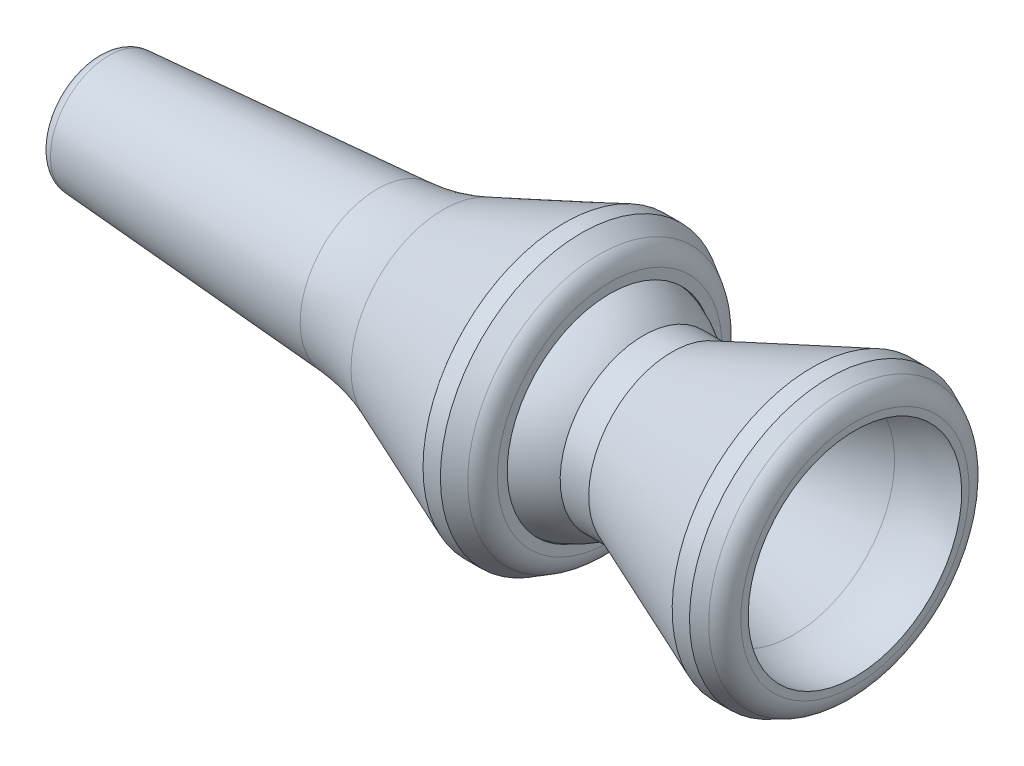
ISO-10303-21;
HEADER;
FILE_DESCRIPTION(('STEP AP214'),'2;1');
FILE_NAME('part.step','',(''),(''),'','','');
FILE_SCHEMA(('AUTOMOTIVE_DESIGN { 1 0 10303 214 1 1 1 1 }'));
ENDSEC;
DATA;
#1=APPLICATION_CONTEXT('core data for automotive mechanical design processes');
#2=APPLICATION_PROTOCOL_DEFINITION('international standard','automotive_design',2000,#1);
#3=PRODUCT_CONTEXT('',#1,'mechanical');
#4=PRODUCT('Part','Part','',(#3));
#5=PRODUCT_RELATED_PRODUCT_CATEGORY('part','',(#4));
#6=PRODUCT_DEFINITION_FORMATION('','',#4);
#7=PRODUCT_DEFINITION_CONTEXT('part definition',#1,'design');
#8=PRODUCT_DEFINITION('design','',#6,#7);
#9=PRODUCT_DEFINITION_SHAPE('','',#8);
#10=(LENGTH_UNIT() NAMED_UNIT(*) SI_UNIT(.MILLI.,.METRE.));
#11=(NAMED_UNIT(*) PLANE_ANGLE_UNIT() SI_UNIT($,.RADIAN.));
#12=(NAMED_UNIT(*) SI_UNIT($,.STERADIAN.) SOLID_ANGLE_UNIT());
#13=UNCERTAINTY_MEASURE_WITH_UNIT(LENGTH_MEASURE(1.E-05),#10,'distance_accuracy_value','');
#14=(GEOMETRIC_REPRESENTATION_CONTEXT(3) GLOBAL_UNCERTAINTY_ASSIGNED_CONTEXT((#13)) GLOBAL_UNIT_ASSIGNED_CONTEXT((#10,
#11,#12)) REPRESENTATION_CONTEXT('',''));
#15=CARTESIAN_POINT('',(0.,0.,0.));
#16=DIRECTION('',(0.,0.,1.));
#17=DIRECTION('',(1.,0.,0.));
#18=AXIS2_PLACEMENT_3D('',#15,#16,#17);
#19=CARTESIAN_POINT('',(-177.5841,3.3655,0.));
#20=DIRECTION('',(1.,0.,0.));
#21=DIRECTION('',(0.,1.,0.));
#22=AXIS2_PLACEMENT_3D('',#19,#20,#21);
#23=PLANE('',#22);
#24=CARTESIAN_POINT('',(-177.5841,0.,0.));
#25=DIRECTION('',(1.,0.,0.));
#26=DIRECTION('',(0.,1.,0.));
#27=AXIS2_PLACEMENT_3D('',#24,#25,#26);
#28=CIRCLE('',#27,2.6549235043631);
#29=CARTESIAN_POINT('',(-177.5841,2.6549235043631,0.));
#30=VERTEX_POINT('',#29);
#31=EDGE_CURVE('E77',#30,#30,#28,.F.);
#32=ORIENTED_EDGE('',*,*,#31,.T.);
#33=EDGE_LOOP('',(#32));
#34=FACE_BOUND('',#33,.T.);
#35=CARTESIAN_POINT('',(-177.5841,0.,0.));
#36=DIRECTION('',(-1.,0.,0.));
#37=DIRECTION('',(0.,-1.,0.));
#38=AXIS2_PLACEMENT_3D('',#35,#36,#37);
#39=CIRCLE('',#38,1.5875);
#40=CARTESIAN_POINT('',(-177.5841,-1.5875,0.));
#41=VERTEX_POINT('',#40);
#42=EDGE_CURVE('E93',#41,#41,#39,.T.);
#43=ORIENTED_EDGE('',*,*,#42,.F.);
#44=EDGE_LOOP('',(#43));
#45=FACE_BOUND('',#44,.T.);
#46=ADVANCED_FACE('F53',(#34,#45),#23,.F.);
#47=CARTESIAN_POINT('',(-177.5841,0.,0.));
#48=DIRECTION('',(1.,0.,0.));
#49=DIRECTION('',(0.,1.,0.));
#50=AXIS2_PLACEMENT_3D('',#47,#48,#49);
#51=CONICAL_SURFACE('',#50,1.5875,0.0698131700797733);
#52=CARTESIAN_POINT('',(-159.235370615463,0.,0.));
#53=DIRECTION('',(-1.,0.,0.));
#54=DIRECTION('',(0.,-1.,0.));
#55=AXIS2_PLACEMENT_3D('',#52,#53,#54);
#56=CIRCLE('',#55,2.87056814907489);
#57=CARTESIAN_POINT('',(-159.235370615463,-2.87056814907489,0.));
#58=VERTEX_POINT('',#57);
#59=EDGE_CURVE('E97',#58,#58,#56,.T.);
#60=ORIENTED_EDGE('',*,*,#59,.F.);
#61=EDGE_LOOP('',(#60));
#62=FACE_BOUND('',#61,.T.);
#63=ORIENTED_EDGE('',*,*,#42,.T.);
#64=EDGE_LOOP('',(#63));
#65=FACE_BOUND('',#64,.T.);
#66=ADVANCED_FACE('F135',(#62,#65),#51,.F.);
#67=CARTESIAN_POINT('',(-159.235370615463,0.,0.));
#68=DIRECTION('',(1.,0.,0.));
#69=DIRECTION('',(0.,1.,0.));
#70=AXIS2_PLACEMENT_3D('',#67,#68,#69);
#71=CONICAL_SURFACE('',#70,2.87056814907489,0.383972435438754);
#72=CARTESIAN_POINT('',(-152.0317,0.,0.));
#73=DIRECTION('',(-1.,0.,0.));
#74=DIRECTION('',(0.,-1.,0.));
#75=AXIS2_PLACEMENT_3D('',#72,#73,#74);
#76=CIRCLE('',#75,5.78104);
#77=CARTESIAN_POINT('',(-152.0317,-5.78103999999999,0.));
#78=VERTEX_POINT('',#77);
#79=EDGE_CURVE('E101',#78,#78,#76,.T.);
#80=ORIENTED_EDGE('',*,*,#79,.F.);
#81=EDGE_LOOP('',(#80));
#82=FACE_BOUND('',#81,.T.);
#83=ORIENTED_EDGE('',*,*,#59,.T.);
#84=EDGE_LOOP('',(#83));
#85=FACE_BOUND('',#84,.T.);
#86=ADVANCED_FACE('F141',(#82,#85),#71,.F.);
#87=CARTESIAN_POINT('',(-149.703467467898,0.,0.));
#88=DIRECTION('',(-1.,0.,0.));
#89=DIRECTION('',(0.,-1.,0.));
#90=AXIS2_PLACEMENT_3D('',#87,#88,#89);
#91=DEGENERATE_TOROIDAL_SURFACE('',#90,0.00370612809085557,6.2357,.F.);
#92=CARTESIAN_POINT('',(-148.0439,0.,0.));
#93=DIRECTION('',(-1.,0.,0.));
#94=DIRECTION('',(0.,-1.,0.));
#95=AXIS2_PLACEMENT_3D('',#92,#93,#94);
#96=CIRCLE('',#95,6.00709999999999);
#97=CARTESIAN_POINT('',(-148.0439,-6.00709999999999,0.));
#98=VERTEX_POINT('',#97);
#99=EDGE_CURVE('E105',#98,#98,#96,.T.);
#100=ORIENTED_EDGE('',*,*,#99,.F.);
#101=EDGE_LOOP('',(#100));
#102=FACE_BOUND('',#101,.T.);
#103=ORIENTED_EDGE('',*,*,#79,.T.);
#104=EDGE_LOOP('',(#103));
#105=FACE_BOUND('',#104,.T.);
#106=ADVANCED_FACE('F170',(#102,#105),#91,.T.);
#107=CARTESIAN_POINT('',(-177.5841,0.,0.));
#108=DIRECTION('',(-1.,0.,0.));
#109=DIRECTION('',(0.,-1.,0.));
#110=AXIS2_PLACEMENT_3D('',#107,#108,#109);
#111=CYLINDRICAL_SURFACE('',#110,6.00709999999999);
#112=CARTESIAN_POINT('',(-147.5359,0.,0.));
#113=DIRECTION('',(-1.,0.,0.));
#114=DIRECTION('',(0.,-1.,0.));
#115=AXIS2_PLACEMENT_3D('',#112,#113,#114);
#116=CIRCLE('',#115,6.00709999999999);
#117=CARTESIAN_POINT('',(-147.5359,-6.00709999999999,0.));
#118=VERTEX_POINT('',#117);
#119=EDGE_CURVE('E109',#118,#118,#116,.T.);
#120=ORIENTED_EDGE('',*,*,#119,.F.);
#121=EDGE_LOOP('',(#120));
#122=FACE_BOUND('',#121,.T.);
#123=ORIENTED_EDGE('',*,*,#99,.T.);
#124=EDGE_LOOP('',(#123));
#125=FACE_BOUND('',#124,.T.);
#126=ADVANCED_FACE('F131',(#122,#125),#111,.F.);
#127=CARTESIAN_POINT('',(-147.5359,7.31449470556792,0.));
#128=DIRECTION('',(-1.,0.,0.));
#129=DIRECTION('',(0.,-1.,0.));
#130=AXIS2_PLACEMENT_3D('',#127,#128,#129);
#131=PLANE('',#130);
#132=CARTESIAN_POINT('',(-147.5359,0.,0.));
#133=DIRECTION('',(-1.,0.,0.));
#134=DIRECTION('',(0.,-1.,0.));
#135=AXIS2_PLACEMENT_3D('',#132,#133,#134);
#136=CIRCLE('',#135,6.5812598636971);
#137=CARTESIAN_POINT('',(-147.5359,-6.58125986369709,0.));
#138=VERTEX_POINT('',#137);
#139=EDGE_CURVE('E66',#138,#138,#136,.F.);
#140=ORIENTED_EDGE('',*,*,#139,.T.);
#141=EDGE_LOOP('',(#140));
#142=FACE_BOUND('',#141,.T.);
#143=ORIENTED_EDGE('',*,*,#119,.T.);
#144=EDGE_LOOP('',(#143));
#145=FACE_BOUND('',#144,.T.);
#146=ADVANCED_FACE('F122',(#142,#145),#131,.F.);
#147=CARTESIAN_POINT('',(-147.5359,0.,0.));
#148=DIRECTION('',(-1.,0.,0.));
#149=DIRECTION('',(0.,-1.,0.));
#150=AXIS2_PLACEMENT_3D('',#147,#148,#149);
#151=CONICAL_SURFACE('',#150,7.31449470556792,0.5235987755983);
#152=CARTESIAN_POINT('',(-148.1709,0.,0.));
#153=DIRECTION('',(1.,0.,0.));
#154=DIRECTION('',(0.,1.,0.));
#155=AXIS2_PLACEMENT_3D('',#152,#153,#154);
#156=CIRCLE('',#155,7.68111212650333);
#157=CARTESIAN_POINT('',(-148.1709,7.68111212650334,0.));
#158=VERTEX_POINT('',#157);
#159=EDGE_CURVE('E71',#158,#158,#156,.F.);
#160=ORIENTED_EDGE('',*,*,#159,.T.);
#161=EDGE_LOOP('',(#160));
#162=FACE_BOUND('',#161,.T.);
#163=CARTESIAN_POINT('',(-149.1869,0.,0.));
#164=DIRECTION('',(-1.,0.,0.));
#165=DIRECTION('',(0.,-1.,0.));
#166=AXIS2_PLACEMENT_3D('',#163,#164,#165);
#167=CIRCLE('',#166,8.26769999999999);
#168=CARTESIAN_POINT('',(-149.1869,-8.26769999999999,0.));
#169=VERTEX_POINT('',#168);
#170=EDGE_CURVE('E113',#169,#169,#167,.T.);
#171=ORIENTED_EDGE('',*,*,#170,.F.);
#172=EDGE_LOOP('',(#171));
#173=FACE_BOUND('',#172,.T.);
#174=ADVANCED_FACE('F120',(#162,#173),#151,.T.);
#175=CARTESIAN_POINT('',(-177.5841,0.,0.));
#176=DIRECTION('',(-1.,0.,0.));
#177=DIRECTION('',(0.,-1.,0.));
#178=AXIS2_PLACEMENT_3D('',#175,#176,#177);
#179=CYLINDRICAL_SURFACE('',#178,8.26769999999999);
#180=CARTESIAN_POINT('',(-150.202406274015,0.,0.));
#181=DIRECTION('',(1.,0.,0.));
#182=DIRECTION('',(0.,1.,0.));
#183=AXIS2_PLACEMENT_3D('',#180,#181,#182);
#184=CIRCLE('',#183,8.26769999999999);
#185=CARTESIAN_POINT('',(-150.202406274015,8.2677,0.));
#186=VERTEX_POINT('',#185);
#187=EDGE_CURVE('E12',#186,#186,#184,.T.);
#188=ORIENTED_EDGE('',*,*,#187,.T.);
#189=EDGE_LOOP('',(#188));
#190=FACE_BOUND('',#189,.T.);
#191=ORIENTED_EDGE('',*,*,#170,.T.);
#192=EDGE_LOOP('',(#191));
#193=FACE_BOUND('',#192,.T.);
#194=ADVANCED_FACE('F118',(#190,#193),#179,.T.);
#195=CARTESIAN_POINT('',(-150.2029,0.,0.));
#196=DIRECTION('',(1.,0.,0.));
#197=DIRECTION('',(0.,1.,0.));
#198=AXIS2_PLACEMENT_3D('',#195,#196,#197);
#199=CONICAL_SURFACE('',#198,8.26769999999999,0.383972435438754);
#200=CARTESIAN_POINT('',(-150.203357774762,0.,0.));
#201=DIRECTION('',(-1.,0.,0.));
#202=DIRECTION('',(0.,-1.,0.));
#203=AXIS2_PLACEMENT_3D('',#200,#201,#202);
#204=CIRCLE('',#203,8.2675150469906);
#205=CARTESIAN_POINT('',(-150.203357774762,-8.26751504699059,0.));
#206=VERTEX_POINT('',#205);
#207=EDGE_CURVE('E61',#206,#206,#204,.T.);
#208=ORIENTED_EDGE('',*,*,#207,.T.);
#209=EDGE_LOOP('',(#208));
#210=FACE_BOUND('',#209,.T.);
#211=CARTESIAN_POINT('',(-157.2798950349,0.,0.));
#212=DIRECTION('',(1.,0.,0.));
#213=DIRECTION('',(0.,1.,0.));
#214=AXIS2_PLACEMENT_3D('',#211,#212,#213);
#215=CIRCLE('',#214,5.4084084057952);
#216=CARTESIAN_POINT('',(-157.2798950349,5.40840840579521,0.));
#217=VERTEX_POINT('',#216);
#218=EDGE_CURVE('E81',#217,#217,#215,.T.);
#219=ORIENTED_EDGE('',*,*,#218,.T.);
#220=EDGE_LOOP('',(#219));
#221=FACE_BOUND('',#220,.T.);
#222=ADVANCED_FACE('F129',(#210,#221),#199,.T.);
#223=CARTESIAN_POINT('',(-159.144909032621,0.,0.));
#224=DIRECTION('',(1.,0.,0.));
#225=DIRECTION('',(0.,1.,0.));
#226=AXIS2_PLACEMENT_3D('',#223,#224,#225);
#227=CONICAL_SURFACE('',#226,4.65489383916642,0.0698131700797733);
#228=CARTESIAN_POINT('',(-161.151491554732,0.,0.));
#229=DIRECTION('',(1.,0.,0.));
#230=DIRECTION('',(0.,1.,0.));
#231=AXIS2_PLACEMENT_3D('',#228,#229,#230);
#232=CIRCLE('',#231,4.51457992049362);
#233=CARTESIAN_POINT('',(-161.151491554732,4.51457992049363,0.));
#234=VERTEX_POINT('',#233);
#235=EDGE_CURVE('E85',#234,#234,#232,.F.);
#236=ORIENTED_EDGE('',*,*,#235,.T.);
#237=EDGE_LOOP('',(#236));
#238=FACE_BOUND('',#237,.T.);
#239=CARTESIAN_POINT('',(-176.875254432993,0.,0.));
#240=DIRECTION('',(-1.,0.,0.));
#241=DIRECTION('',(0.,-1.,0.));
#242=AXIS2_PLACEMENT_3D('',#239,#240,#241);
#243=CIRCLE('',#242,3.41506731066109);
#244=CARTESIAN_POINT('',(-176.875254432993,-3.41506731066109,0.));
#245=VERTEX_POINT('',#244);
#246=EDGE_CURVE('E89',#245,#245,#243,.F.);
#247=ORIENTED_EDGE('',*,*,#246,.T.);
#248=EDGE_LOOP('',(#247));
#249=FACE_BOUND('',#248,.T.);
#250=ADVANCED_FACE('F151',(#238,#249),#227,.T.);
#251=CARTESIAN_POINT('',(-162.037398771282,0.,0.));
#252=DIRECTION('',(-1.,0.,0.));
#253=DIRECTION('',(0.,-1.,0.));
#254=AXIS2_PLACEMENT_3D('',#251,#252,#253);
#255=TOROIDAL_SURFACE('',#254,17.1836433587934,12.7);
#256=ORIENTED_EDGE('',*,*,#218,.F.);
#257=EDGE_LOOP('',(#256));
#258=FACE_BOUND('',#257,.T.);
#259=ORIENTED_EDGE('',*,*,#235,.F.);
#260=EDGE_LOOP('',(#259));
#261=FACE_BOUND('',#260,.T.);
#262=ADVANCED_FACE('F147',(#258,#261),#255,.F.);
#263=CARTESIAN_POINT('',(-176.8221,0.,0.));
#264=DIRECTION('',(1.,0.,0.));
#265=DIRECTION('',(0.,1.,0.));
#266=AXIS2_PLACEMENT_3D('',#263,#264,#265);
#267=TOROIDAL_SURFACE('',#266,2.6549235043631,0.762);
#268=ORIENTED_EDGE('',*,*,#246,.F.);
#269=EDGE_LOOP('',(#268));
#270=FACE_BOUND('',#269,.T.);
#271=ORIENTED_EDGE('',*,*,#31,.F.);
#272=EDGE_LOOP('',(#271));
#273=FACE_BOUND('',#272,.T.);
#274=ADVANCED_FACE('F150',(#270,#273),#267,.T.);
#275=CARTESIAN_POINT('',(-148.8059,0.,0.));
#276=DIRECTION('',(-1.,0.,0.));
#277=DIRECTION('',(0.,-1.,0.));
#278=AXIS2_PLACEMENT_3D('',#275,#276,#277);
#279=TOROIDAL_SURFACE('',#278,6.5812598636971,1.27);
#280=ORIENTED_EDGE('',*,*,#139,.F.);
#281=EDGE_LOOP('',(#280));
#282=FACE_BOUND('',#281,.T.);
#283=ORIENTED_EDGE('',*,*,#159,.F.);
#284=EDGE_LOOP('',(#283));
#285=FACE_BOUND('',#284,.T.);
#286=ADVANCED_FACE('F154',(#282,#285),#279,.T.);
#287=CARTESIAN_POINT('',(-150.202406274015,0.,0.));
#288=DIRECTION('',(1.,0.,0.));
#289=DIRECTION('',(0.,1.,0.));
#290=AXIS2_PLACEMENT_3D('',#287,#288,#289);
#291=TOROIDAL_SURFACE('',#290,8.26515999999999,0.00254);
#292=ORIENTED_EDGE('',*,*,#187,.F.);
#293=EDGE_LOOP('',(#292));
#294=FACE_BOUND('',#293,.T.);
#295=ORIENTED_EDGE('',*,*,#207,.F.);
#296=EDGE_LOOP('',(#295));
#297=FACE_BOUND('',#296,.T.);
#298=ADVANCED_FACE('F55',(#294,#297),#291,.T.);
#299=CLOSED_SHELL('',(#46,#66,#86,#106,#126,#146,#174,#194,#222,#250,#262,#274,#286,#298));
#300=MANIFOLD_SOLID_BREP('B2',#299);
#301=CARTESIAN_POINT('',(-149.52952572709,0.,0.));
#302=DIRECTION('',(-1.,0.,0.));
#303=DIRECTION('',(0.,-1.,0.));
#304=AXIS2_PLACEMENT_3D('',#301,#302,#303);
#305=DEGENERATE_TOROIDAL_SURFACE('',#304,0.000186321539720683,6.2865,.T.);
#306=CARTESIAN_POINT('',(-152.4,0.,0.));
#307=DIRECTION('',(-1.,0.,0.));
#308=DIRECTION('',(0.,-1.,0.));
#309=AXIS2_PLACEMENT_3D('',#306,#307,#308);
#310=CIRCLE('',#309,5.59307999999999);
#311=CARTESIAN_POINT('',(-152.4,-5.59307999999997,0.));
#312=VERTEX_POINT('',#311);
#313=EDGE_CURVE('E321',#312,#312,#310,.T.);
#314=ORIENTED_EDGE('',*,*,#313,.F.);
#315=EDGE_LOOP('',(#314));
#316=FACE_BOUND('',#315,.T.);
#317=CARTESIAN_POINT('',(-145.56232,0.,0.));
#318=DIRECTION('',(-1.,0.,0.));
#319=DIRECTION('',(0.,-1.,0.));
#320=AXIS2_PLACEMENT_3D('',#317,#318,#319);
#321=CIRCLE('',#320,4.87679999999998);
#322=CARTESIAN_POINT('',(-145.56232,-4.87679999999996,0.));
#323=VERTEX_POINT('',#322);
#324=EDGE_CURVE('E348',#323,#323,#321,.T.);
#325=ORIENTED_EDGE('',*,*,#324,.T.);
#326=EDGE_LOOP('',(#325));
#327=FACE_BOUND('',#326,.T.);
#328=ADVANCED_FACE('F301',(#316,#327),#305,.T.);
#329=CARTESIAN_POINT('',(-152.4,5.59308,0.));
#330=DIRECTION('',(1.,0.,0.));
#331=DIRECTION('',(0.,1.,0.));
#332=AXIS2_PLACEMENT_3D('',#329,#330,#331);
#333=PLANE('',#332);
#334=CARTESIAN_POINT('',(-152.4,0.,0.));
#335=DIRECTION('',(1.,0.,0.));
#336=DIRECTION('',(0.,1.,0.));
#337=AXIS2_PLACEMENT_3D('',#334,#335,#336);
#338=CIRCLE('',#337,4.68603720415648);
#339=CARTESIAN_POINT('',(-152.4,4.6860372041565,0.));
#340=VERTEX_POINT('',#339);
#341=EDGE_CURVE('E52',#340,#340,#338,.T.);
#342=ORIENTED_EDGE('',*,*,#341,.T.);
#343=EDGE_LOOP('',(#342));
#344=FACE_BOUND('',#343,.T.);
#345=ORIENTED_EDGE('',*,*,#313,.T.);
#346=EDGE_LOOP('',(#345));
#347=FACE_BOUND('',#346,.T.);
#348=ADVANCED_FACE('F384',(#344,#347),#333,.F.);
#349=CARTESIAN_POINT('',(-295.1861,0.,0.));
#350=DIRECTION('',(-1.,0.,0.));
#351=DIRECTION('',(0.,-1.,0.));
#352=AXIS2_PLACEMENT_3D('',#349,#350,#351);
#353=CYLINDRICAL_SURFACE('',#352,4.50849999999998);
#354=CARTESIAN_POINT('',(-151.96058,0.,0.));
#355=DIRECTION('',(1.,0.,0.));
#356=DIRECTION('',(0.,1.,0.));
#357=AXIS2_PLACEMENT_3D('',#354,#355,#356);
#358=CIRCLE('',#357,4.50849999999998);
#359=CARTESIAN_POINT('',(-151.96058,4.5085,0.));
#360=VERTEX_POINT('',#359);
#361=EDGE_CURVE('E308',#360,#360,#358,.F.);
#362=ORIENTED_EDGE('',*,*,#361,.T.);
#363=EDGE_LOOP('',(#362));
#364=FACE_BOUND('',#363,.T.);
#365=CARTESIAN_POINT('',(-148.268884751893,0.,0.));
#366=DIRECTION('',(-1.,0.,0.));
#367=DIRECTION('',(0.,-1.,0.));
#368=AXIS2_PLACEMENT_3D('',#365,#366,#367);
#369=CIRCLE('',#368,4.50849999999998);
#370=CARTESIAN_POINT('',(-148.268884751893,-4.50849999999997,0.));
#371=VERTEX_POINT('',#370);
#372=EDGE_CURVE('E324',#371,#371,#369,.T.);
#373=ORIENTED_EDGE('',*,*,#372,.F.);
#374=EDGE_LOOP('',(#373));
#375=FACE_BOUND('',#374,.T.);
#376=ADVANCED_FACE('F390',(#364,#375),#353,.F.);
#377=CARTESIAN_POINT('',(-148.268884751893,0.,0.));
#378=DIRECTION('',(-1.,0.,0.));
#379=DIRECTION('',(0.,-1.,0.));
#380=AXIS2_PLACEMENT_3D('',#377,#378,#379);
#381=CONICAL_SURFACE('',#380,4.50849999999998,0.523598775598303);
#382=CARTESIAN_POINT('',(-145.959195,0.,0.));
#383=DIRECTION('',(-1.,0.,0.));
#384=DIRECTION('',(0.,-1.,0.));
#385=AXIS2_PLACEMENT_3D('',#382,#383,#384);
#386=CIRCLE('',#385,3.17499999999998);
#387=CARTESIAN_POINT('',(-145.959195,-3.17499999999996,0.));
#388=VERTEX_POINT('',#387);
#389=EDGE_CURVE('E327',#388,#388,#386,.T.);
#390=ORIENTED_EDGE('',*,*,#389,.F.);
#391=EDGE_LOOP('',(#390));
#392=FACE_BOUND('',#391,.T.);
#393=ORIENTED_EDGE('',*,*,#372,.T.);
#394=EDGE_LOOP('',(#393));
#395=FACE_BOUND('',#394,.T.);
#396=ADVANCED_FACE('F420',(#392,#395),#381,.F.);
#397=CARTESIAN_POINT('',(-295.1861,0.,0.));
#398=DIRECTION('',(-1.,0.,0.));
#399=DIRECTION('',(0.,-1.,0.));
#400=AXIS2_PLACEMENT_3D('',#397,#398,#399);
#401=CYLINDRICAL_SURFACE('',#400,3.17499999999998);
#402=CARTESIAN_POINT('',(-143.560203589909,0.,0.));
#403=DIRECTION('',(-1.,0.,0.));
#404=DIRECTION('',(0.,-1.,0.));
#405=AXIS2_PLACEMENT_3D('',#402,#403,#404);
#406=CIRCLE('',#405,3.17499999999998);
#407=CARTESIAN_POINT('',(-143.560203589909,-3.17499999999996,0.));
#408=VERTEX_POINT('',#407);
#409=EDGE_CURVE('E330',#408,#408,#406,.T.);
#410=ORIENTED_EDGE('',*,*,#409,.F.);
#411=EDGE_LOOP('',(#410));
#412=FACE_BOUND('',#411,.T.);
#413=ORIENTED_EDGE('',*,*,#389,.T.);
#414=EDGE_LOOP('',(#413));
#415=FACE_BOUND('',#414,.T.);
#416=ADVANCED_FACE('F414',(#412,#415),#401,.F.);
#417=CARTESIAN_POINT('',(-143.560203589909,0.,0.));
#418=DIRECTION('',(1.,0.,0.));
#419=DIRECTION('',(0.,1.,0.));
#420=AXIS2_PLACEMENT_3D('',#417,#418,#419);
#421=CONICAL_SURFACE('',#420,3.17499999999998,0.383972435438753);
#422=CARTESIAN_POINT('',(-136.76938220631,0.,0.));
#423=DIRECTION('',(-1.,0.,0.));
#424=DIRECTION('',(0.,-1.,0.));
#425=AXIS2_PLACEMENT_3D('',#422,#423,#424);
#426=CIRCLE('',#425,5.91866993393615);
#427=CARTESIAN_POINT('',(-136.76938220631,-5.91866993393613,0.));
#428=VERTEX_POINT('',#427);
#429=EDGE_CURVE('E333',#428,#428,#426,.T.);
#430=ORIENTED_EDGE('',*,*,#429,.F.);
#431=EDGE_LOOP('',(#430));
#432=FACE_BOUND('',#431,.T.);
#433=ORIENTED_EDGE('',*,*,#409,.T.);
#434=EDGE_LOOP('',(#433));
#435=FACE_BOUND('',#434,.T.);
#436=ADVANCED_FACE('F408',(#432,#435),#421,.F.);
#437=CARTESIAN_POINT('',(-134.414417856801,0.,0.));
#438=DIRECTION('',(-1.,0.,0.));
#439=DIRECTION('',(0.,-1.,0.));
#440=AXIS2_PLACEMENT_3D('',#437,#438,#439);
#441=DEGENERATE_TOROIDAL_SURFACE('',#440,0.0899286322020409,6.28650000000002,.T.);
#442=CARTESIAN_POINT('',(-133.1722,0.,0.));
#443=DIRECTION('',(-1.,0.,0.));
#444=DIRECTION('',(0.,-1.,0.));
#445=AXIS2_PLACEMENT_3D('',#442,#443,#444);
#446=CIRCLE('',#445,6.25247494409651);
#447=CARTESIAN_POINT('',(-133.1722,-6.25247494409649,0.));
#448=VERTEX_POINT('',#447);
#449=EDGE_CURVE('E336',#448,#448,#446,.T.);
#450=ORIENTED_EDGE('',*,*,#449,.F.);
#451=EDGE_LOOP('',(#450));
#452=FACE_BOUND('',#451,.T.);
#453=ORIENTED_EDGE('',*,*,#429,.T.);
#454=EDGE_LOOP('',(#453));
#455=FACE_BOUND('',#454,.T.);
#456=ADVANCED_FACE('F380',(#452,#455),#441,.F.);
#457=CARTESIAN_POINT('',(-133.1722,7.49269134348892,0.));
#458=DIRECTION('',(-1.,0.,0.));
#459=DIRECTION('',(0.,-1.,0.));
#460=AXIS2_PLACEMENT_3D('',#457,#458,#459);
#461=PLANE('',#460);
#462=CARTESIAN_POINT('',(-133.1722,0.,0.));
#463=DIRECTION('',(-1.,0.,0.));
#464=DIRECTION('',(0.,-1.,0.));
#465=AXIS2_PLACEMENT_3D('',#462,#463,#464);
#466=CIRCLE('',#465,6.68361211226338);
#467=CARTESIAN_POINT('',(-133.1722,-6.68361211226336,0.));
#468=VERTEX_POINT('',#467);
#469=EDGE_CURVE('E312',#468,#468,#466,.F.);
#470=ORIENTED_EDGE('',*,*,#469,.T.);
#471=EDGE_LOOP('',(#470));
#472=FACE_BOUND('',#471,.T.);
#473=ORIENTED_EDGE('',*,*,#449,.T.);
#474=EDGE_LOOP('',(#473));
#475=FACE_BOUND('',#474,.T.);
#476=ADVANCED_FACE('F374',(#472,#475),#461,.F.);
#477=CARTESIAN_POINT('',(-133.1722,0.,0.));
#478=DIRECTION('',(-1.,0.,0.));
#479=DIRECTION('',(0.,-1.,0.));
#480=AXIS2_PLACEMENT_3D('',#477,#478,#479);
#481=CONICAL_SURFACE('',#480,7.4926913434889,0.43633231299858);
#482=CARTESIAN_POINT('',(-133.905474807589,0.,0.));
#483=DIRECTION('',(1.,0.,0.));
#484=DIRECTION('',(0.,1.,0.));
#485=AXIS2_PLACEMENT_3D('',#482,#483,#484);
#486=CIRCLE('',#485,7.83462300179993);
#487=CARTESIAN_POINT('',(-133.905474807589,7.83462300179995,0.));
#488=VERTEX_POINT('',#487);
#489=EDGE_CURVE('E316',#488,#488,#486,.F.);
#490=ORIENTED_EDGE('',*,*,#489,.T.);
#491=EDGE_LOOP('',(#490));
#492=FACE_BOUND('',#491,.T.);
#493=CARTESIAN_POINT('',(-134.6708,0.,0.));
#494=DIRECTION('',(-1.,0.,0.));
#495=DIRECTION('',(0.,-1.,0.));
#496=AXIS2_PLACEMENT_3D('',#493,#494,#495);
#497=CIRCLE('',#496,8.19149999999998);
#498=CARTESIAN_POINT('',(-134.6708,-8.19149999999996,0.));
#499=VERTEX_POINT('',#498);
#500=EDGE_CURVE('E339',#499,#499,#497,.T.);
#501=ORIENTED_EDGE('',*,*,#500,.F.);
#502=EDGE_LOOP('',(#501));
#503=FACE_BOUND('',#502,.T.);
#504=ADVANCED_FACE('F369',(#492,#503),#481,.T.);
#505=CARTESIAN_POINT('',(-295.1861,0.,0.));
#506=DIRECTION('',(-1.,0.,0.));
#507=DIRECTION('',(0.,-1.,0.));
#508=AXIS2_PLACEMENT_3D('',#505,#506,#507);
#509=CYLINDRICAL_SURFACE('',#508,8.19149999999998);
#510=CARTESIAN_POINT('',(-135.686829606981,0.,0.));
#511=DIRECTION('',(-1.,0.,0.));
#512=DIRECTION('',(0.,-1.,0.));
#513=AXIS2_PLACEMENT_3D('',#510,#511,#512);
#514=CIRCLE('',#513,8.19149999999998);
#515=CARTESIAN_POINT('',(-135.686829606981,-8.19149999999996,0.));
#516=VERTEX_POINT('',#515);
#517=EDGE_CURVE('E342',#516,#516,#514,.T.);
#518=ORIENTED_EDGE('',*,*,#517,.F.);
#519=EDGE_LOOP('',(#518));
#520=FACE_BOUND('',#519,.T.);
#521=ORIENTED_EDGE('',*,*,#500,.T.);
#522=EDGE_LOOP('',(#521));
#523=FACE_BOUND('',#522,.T.);
#524=ADVANCED_FACE('F363',(#520,#523),#509,.T.);
#525=CARTESIAN_POINT('',(-135.686829606981,0.,0.));
#526=DIRECTION('',(1.,0.,0.));
#527=DIRECTION('',(0.,1.,0.));
#528=AXIS2_PLACEMENT_3D('',#525,#526,#527);
#529=CONICAL_SURFACE('',#528,8.19149999999998,0.383972435438754);
#530=CARTESIAN_POINT('',(-143.891,0.,0.));
#531=DIRECTION('',(-1.,0.,0.));
#532=DIRECTION('',(0.,-1.,0.));
#533=AXIS2_PLACEMENT_3D('',#530,#531,#532);
#534=CIRCLE('',#533,4.87679999999998);
#535=CARTESIAN_POINT('',(-143.891,-4.87679999999996,0.));
#536=VERTEX_POINT('',#535);
#537=EDGE_CURVE('E345',#536,#536,#534,.T.);
#538=ORIENTED_EDGE('',*,*,#537,.F.);
#539=EDGE_LOOP('',(#538));
#540=FACE_BOUND('',#539,.T.);
#541=ORIENTED_EDGE('',*,*,#517,.T.);
#542=EDGE_LOOP('',(#541));
#543=FACE_BOUND('',#542,.T.);
#544=ADVANCED_FACE('F357',(#540,#543),#529,.T.);
#545=CARTESIAN_POINT('',(-295.1861,0.,0.));
#546=DIRECTION('',(-1.,0.,0.));
#547=DIRECTION('',(0.,-1.,0.));
#548=AXIS2_PLACEMENT_3D('',#545,#546,#547);
#549=CYLINDRICAL_SURFACE('',#548,4.87679999999998);
#550=ORIENTED_EDGE('',*,*,#324,.F.);
#551=EDGE_LOOP('',(#550));
#552=FACE_BOUND('',#551,.T.);
#553=ORIENTED_EDGE('',*,*,#537,.T.);
#554=EDGE_LOOP('',(#553));
#555=FACE_BOUND('',#554,.T.);
#556=ADVANCED_FACE('F353',(#552,#555),#549,.T.);
#557=CARTESIAN_POINT('',(-134.4422,0.,0.));
#558=DIRECTION('',(-1.,0.,0.));
#559=DIRECTION('',(0.,-1.,0.));
#560=AXIS2_PLACEMENT_3D('',#557,#558,#559);
#561=TOROIDAL_SURFACE('',#560,6.68361211226338,1.27);
#562=ORIENTED_EDGE('',*,*,#469,.F.);
#563=EDGE_LOOP('',(#562));
#564=FACE_BOUND('',#563,.T.);
#565=ORIENTED_EDGE('',*,*,#489,.F.);
#566=EDGE_LOOP('',(#565));
#567=FACE_BOUND('',#566,.T.);
#568=ADVANCED_FACE('F356',(#564,#567),#561,.T.);
#569=CARTESIAN_POINT('',(-151.96058,0.,0.));
#570=DIRECTION('',(-1.,0.,0.));
#571=DIRECTION('',(0.,-1.,0.));
#572=AXIS2_PLACEMENT_3D('',#569,#570,#571);
#573=CONICAL_SURFACE('',#572,4.50849999999998,0.383972435438737);
#574=ORIENTED_EDGE('',*,*,#341,.F.);
#575=EDGE_LOOP('',(#574));
#576=FACE_BOUND('',#575,.T.);
#577=ORIENTED_EDGE('',*,*,#361,.F.);
#578=EDGE_LOOP('',(#577));
#579=FACE_BOUND('',#578,.T.);
#580=ADVANCED_FACE('F303',(#576,#579),#573,.F.);
#581=CLOSED_SHELL('',(#328,#348,#376,#396,#416,#436,#456,#476,#504,#524,#544,#556,#568,#580));
#582=MANIFOLD_SOLID_BREP('B7',#581);
#583=ADVANCED_BREP_SHAPE_REPRESENTATION('',(#18,#300,#582),#14);
#584=SHAPE_DEFINITION_REPRESENTATION(#9,#583);
ENDSEC;
END-ISO-10303-21;
